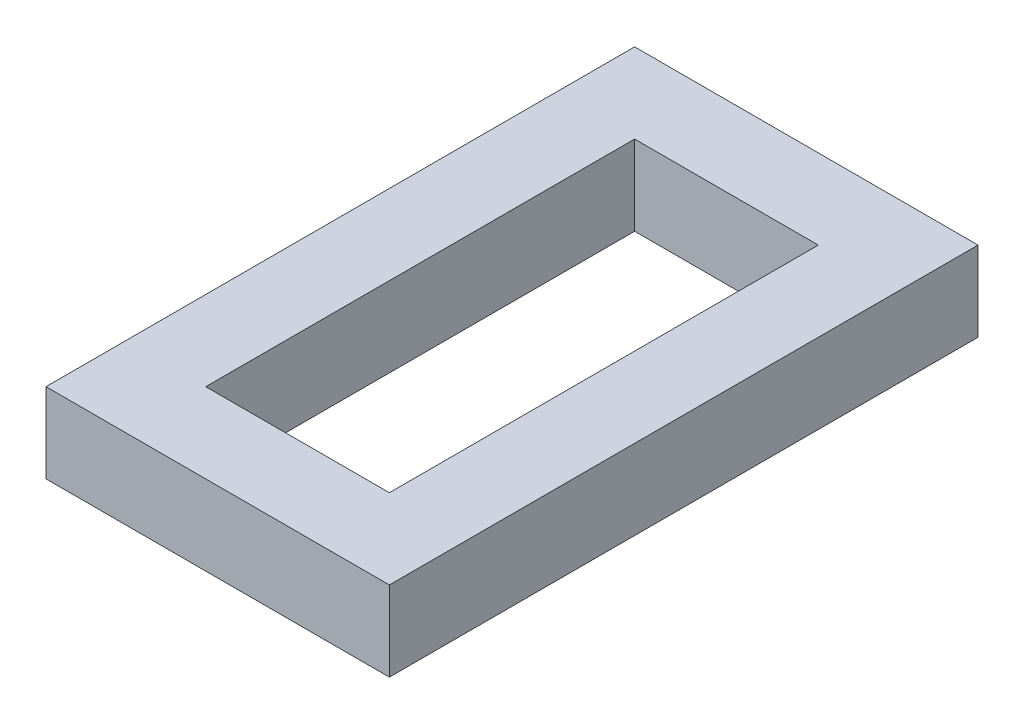
ISO-10303-21;
HEADER;
FILE_DESCRIPTION(('STEP AP214'),'2;1');
FILE_NAME('part.step','',(''),(''),'','','');
FILE_SCHEMA(('AUTOMOTIVE_DESIGN { 1 0 10303 214 1 1 1 1 }'));
ENDSEC;
DATA;
#1=APPLICATION_CONTEXT('core data for automotive mechanical design processes');
#2=APPLICATION_PROTOCOL_DEFINITION('international standard','automotive_design',2000,#1);
#3=PRODUCT_CONTEXT('',#1,'mechanical');
#4=PRODUCT('Part','Part','',(#3));
#5=PRODUCT_RELATED_PRODUCT_CATEGORY('part','',(#4));
#6=PRODUCT_DEFINITION_FORMATION('','',#4);
#7=PRODUCT_DEFINITION_CONTEXT('part definition',#1,'design');
#8=PRODUCT_DEFINITION('design','',#6,#7);
#9=PRODUCT_DEFINITION_SHAPE('','',#8);
#10=(LENGTH_UNIT() NAMED_UNIT(*) SI_UNIT(.MILLI.,.METRE.));
#11=(NAMED_UNIT(*) PLANE_ANGLE_UNIT() SI_UNIT($,.RADIAN.));
#12=(NAMED_UNIT(*) SI_UNIT($,.STERADIAN.) SOLID_ANGLE_UNIT());
#13=UNCERTAINTY_MEASURE_WITH_UNIT(LENGTH_MEASURE(1.E-05),#10,'distance_accuracy_value','');
#14=(GEOMETRIC_REPRESENTATION_CONTEXT(3) GLOBAL_UNCERTAINTY_ASSIGNED_CONTEXT((#13)) GLOBAL_UNIT_ASSIGNED_CONTEXT((#10,
#11,#12)) REPRESENTATION_CONTEXT('',''));
#15=CARTESIAN_POINT('',(0.,0.,0.));
#16=DIRECTION('',(0.,0.,1.));
#17=DIRECTION('',(1.,0.,0.));
#18=AXIS2_PLACEMENT_3D('',#15,#16,#17);
#19=CARTESIAN_POINT('',(0.,15.875,0.));
#20=DIRECTION('',(0.,-1.,0.));
#21=DIRECTION('',(0.,0.,-1.));
#22=AXIS2_PLACEMENT_3D('',#19,#20,#21);
#23=PLANE('',#22);
#24=DIRECTION('',(0.,0.,-1.));
#25=VECTOR('',#24,1.);
#26=CARTESIAN_POINT('',(34.125,15.875,58.5));
#27=LINE('',#26,#25);
#28=CARTESIAN_POINT('',(34.125,15.875,58.5));
#29=VERTEX_POINT('',#28);
#30=CARTESIAN_POINT('',(34.125,15.875,-58.5));
#31=VERTEX_POINT('',#30);
#32=EDGE_CURVE('E153',#29,#31,#27,.T.);
#33=ORIENTED_EDGE('',*,*,#32,.T.);
#34=DIRECTION('',(-1.,0.,0.));
#35=VECTOR('',#34,1.);
#36=CARTESIAN_POINT('',(-34.125,15.875,-58.5));
#37=LINE('',#36,#35);
#38=CARTESIAN_POINT('',(-34.125,15.875,-58.5));
#39=VERTEX_POINT('',#38);
#40=EDGE_CURVE('E157',#31,#39,#37,.T.);
#41=ORIENTED_EDGE('',*,*,#40,.T.);
#42=DIRECTION('',(0.,0.,1.));
#43=VECTOR('',#42,1.);
#44=CARTESIAN_POINT('',(-34.125,15.875,58.5));
#45=LINE('',#44,#43);
#46=CARTESIAN_POINT('',(-34.125,15.875,58.5));
#47=VERTEX_POINT('',#46);
#48=EDGE_CURVE('E161',#39,#47,#45,.T.);
#49=ORIENTED_EDGE('',*,*,#48,.T.);
#50=DIRECTION('',(1.,0.,0.));
#51=VECTOR('',#50,1.);
#52=CARTESIAN_POINT('',(-34.125,15.875,58.5));
#53=LINE('',#52,#51);
#54=EDGE_CURVE('E164',#47,#29,#53,.T.);
#55=ORIENTED_EDGE('',*,*,#54,.T.);
#56=EDGE_LOOP('',(#33,#41,#49,#55));
#57=FACE_BOUND('',#56,.T.);
#58=DIRECTION('',(1.,0.,0.));
#59=VECTOR('',#58,1.);
#60=CARTESIAN_POINT('',(-18.25,15.875,42.625));
#61=LINE('',#60,#59);
#62=CARTESIAN_POINT('',(-18.25,15.875,42.625));
#63=VERTEX_POINT('',#62);
#64=CARTESIAN_POINT('',(18.25,15.875,42.625));
#65=VERTEX_POINT('',#64);
#66=EDGE_CURVE('E105',#63,#65,#61,.T.);
#67=ORIENTED_EDGE('',*,*,#66,.F.);
#68=DIRECTION('',(0.,0.,1.));
#69=VECTOR('',#68,1.);
#70=CARTESIAN_POINT('',(-18.25,15.875,42.625));
#71=LINE('',#70,#69);
#72=CARTESIAN_POINT('',(-18.25,15.875,-42.625));
#73=VERTEX_POINT('',#72);
#74=EDGE_CURVE('E131',#73,#63,#71,.T.);
#75=ORIENTED_EDGE('',*,*,#74,.F.);
#76=DIRECTION('',(-1.,0.,0.));
#77=VECTOR('',#76,1.);
#78=CARTESIAN_POINT('',(-18.25,15.875,-42.625));
#79=LINE('',#78,#77);
#80=CARTESIAN_POINT('',(18.25,15.875,-42.625));
#81=VERTEX_POINT('',#80);
#82=EDGE_CURVE('E127',#81,#73,#79,.T.);
#83=ORIENTED_EDGE('',*,*,#82,.F.);
#84=DIRECTION('',(0.,0.,-1.));
#85=VECTOR('',#84,1.);
#86=CARTESIAN_POINT('',(18.25,15.875,42.625));
#87=LINE('',#86,#85);
#88=EDGE_CURVE('E114',#65,#81,#87,.T.);
#89=ORIENTED_EDGE('',*,*,#88,.F.);
#90=EDGE_LOOP('',(#67,#75,#83,#89));
#91=FACE_BOUND('',#90,.T.);
#92=ADVANCED_FACE('F39',(#57,#91),#23,.F.);
#93=CARTESIAN_POINT('',(0.,0.,0.));
#94=DIRECTION('',(0.,-1.,0.));
#95=DIRECTION('',(0.,0.,-1.));
#96=AXIS2_PLACEMENT_3D('',#93,#94,#95);
#97=PLANE('',#96);
#98=DIRECTION('',(0.,0.,-1.));
#99=VECTOR('',#98,1.);
#100=CARTESIAN_POINT('',(34.125,0.,58.5));
#101=LINE('',#100,#99);
#102=CARTESIAN_POINT('',(34.125,0.,58.5));
#103=VERTEX_POINT('',#102);
#104=CARTESIAN_POINT('',(34.125,0.,-58.5));
#105=VERTEX_POINT('',#104);
#106=EDGE_CURVE('E123',#103,#105,#101,.T.);
#107=ORIENTED_EDGE('',*,*,#106,.F.);
#108=DIRECTION('',(1.,0.,0.));
#109=VECTOR('',#108,1.);
#110=CARTESIAN_POINT('',(-34.125,0.,58.5));
#111=LINE('',#110,#109);
#112=CARTESIAN_POINT('',(-34.125,0.,58.5));
#113=VERTEX_POINT('',#112);
#114=EDGE_CURVE('E158',#113,#103,#111,.T.);
#115=ORIENTED_EDGE('',*,*,#114,.F.);
#116=DIRECTION('',(0.,0.,1.));
#117=VECTOR('',#116,1.);
#118=CARTESIAN_POINT('',(-34.125,0.,58.5));
#119=LINE('',#118,#117);
#120=CARTESIAN_POINT('',(-34.125,0.,-58.5));
#121=VERTEX_POINT('',#120);
#122=EDGE_CURVE('E174',#121,#113,#119,.T.);
#123=ORIENTED_EDGE('',*,*,#122,.F.);
#124=DIRECTION('',(-1.,0.,0.));
#125=VECTOR('',#124,1.);
#126=CARTESIAN_POINT('',(-34.125,0.,-58.5));
#127=LINE('',#126,#125);
#128=EDGE_CURVE('E171',#105,#121,#127,.T.);
#129=ORIENTED_EDGE('',*,*,#128,.F.);
#130=EDGE_LOOP('',(#107,#115,#123,#129));
#131=FACE_BOUND('',#130,.T.);
#132=DIRECTION('',(0.,0.,1.));
#133=VECTOR('',#132,1.);
#134=CARTESIAN_POINT('',(-18.25,0.,42.625));
#135=LINE('',#134,#133);
#136=CARTESIAN_POINT('',(-18.25,0.,-42.625));
#137=VERTEX_POINT('',#136);
#138=CARTESIAN_POINT('',(-18.25,0.,42.625));
#139=VERTEX_POINT('',#138);
#140=EDGE_CURVE('E115',#137,#139,#135,.T.);
#141=ORIENTED_EDGE('',*,*,#140,.T.);
#142=DIRECTION('',(1.,0.,0.));
#143=VECTOR('',#142,1.);
#144=CARTESIAN_POINT('',(-18.25,0.,42.625));
#145=LINE('',#144,#143);
#146=CARTESIAN_POINT('',(18.25,0.,42.625));
#147=VERTEX_POINT('',#146);
#148=EDGE_CURVE('E63',#139,#147,#145,.T.);
#149=ORIENTED_EDGE('',*,*,#148,.T.);
#150=DIRECTION('',(0.,0.,-1.));
#151=VECTOR('',#150,1.);
#152=CARTESIAN_POINT('',(18.25,0.,42.625));
#153=LINE('',#152,#151);
#154=CARTESIAN_POINT('',(18.25,0.,-42.625));
#155=VERTEX_POINT('',#154);
#156=EDGE_CURVE('E121',#147,#155,#153,.T.);
#157=ORIENTED_EDGE('',*,*,#156,.T.);
#158=DIRECTION('',(-1.,0.,0.));
#159=VECTOR('',#158,1.);
#160=CARTESIAN_POINT('',(-18.25,0.,-42.625));
#161=LINE('',#160,#159);
#162=EDGE_CURVE('E140',#155,#137,#161,.T.);
#163=ORIENTED_EDGE('',*,*,#162,.T.);
#164=EDGE_LOOP('',(#141,#149,#157,#163));
#165=FACE_BOUND('',#164,.T.);
#166=ADVANCED_FACE('F197',(#131,#165),#97,.T.);
#167=CARTESIAN_POINT('',(34.125,15.875,58.5));
#168=DIRECTION('',(-1.,0.,0.));
#169=DIRECTION('',(0.,0.,1.));
#170=AXIS2_PLACEMENT_3D('',#167,#168,#169);
#171=PLANE('',#170);
#172=ORIENTED_EDGE('',*,*,#106,.T.);
#173=DIRECTION('',(0.,-1.,0.));
#174=VECTOR('',#173,1.);
#175=CARTESIAN_POINT('',(34.125,15.875,-58.5));
#176=LINE('',#175,#174);
#177=EDGE_CURVE('E11',#31,#105,#176,.T.);
#178=ORIENTED_EDGE('',*,*,#177,.F.);
#179=ORIENTED_EDGE('',*,*,#32,.F.);
#180=DIRECTION('',(0.,-1.,0.));
#181=VECTOR('',#180,1.);
#182=CARTESIAN_POINT('',(34.125,15.875,58.5));
#183=LINE('',#182,#181);
#184=EDGE_CURVE('E167',#29,#103,#183,.T.);
#185=ORIENTED_EDGE('',*,*,#184,.T.);
#186=EDGE_LOOP('',(#172,#178,#179,#185));
#187=FACE_BOUND('',#186,.T.);
#188=ADVANCED_FACE('F41',(#187),#171,.F.);
#189=CARTESIAN_POINT('',(-34.125,15.875,-58.5));
#190=DIRECTION('',(0.,0.,1.));
#191=DIRECTION('',(1.,0.,0.));
#192=AXIS2_PLACEMENT_3D('',#189,#190,#191);
#193=PLANE('',#192);
#194=ORIENTED_EDGE('',*,*,#128,.T.);
#195=DIRECTION('',(0.,-1.,0.));
#196=VECTOR('',#195,1.);
#197=CARTESIAN_POINT('',(-34.125,15.875,-58.5));
#198=LINE('',#197,#196);
#199=EDGE_CURVE('E48',#39,#121,#198,.T.);
#200=ORIENTED_EDGE('',*,*,#199,.F.);
#201=ORIENTED_EDGE('',*,*,#40,.F.);
#202=ORIENTED_EDGE('',*,*,#177,.T.);
#203=EDGE_LOOP('',(#194,#200,#201,#202));
#204=FACE_BOUND('',#203,.T.);
#205=ADVANCED_FACE('F207',(#204),#193,.F.);
#206=CARTESIAN_POINT('',(-34.125,15.875,58.5));
#207=DIRECTION('',(1.,0.,0.));
#208=DIRECTION('',(0.,0.,-1.));
#209=AXIS2_PLACEMENT_3D('',#206,#207,#208);
#210=PLANE('',#209);
#211=ORIENTED_EDGE('',*,*,#122,.T.);
#212=DIRECTION('',(0.,-1.,0.));
#213=VECTOR('',#212,1.);
#214=CARTESIAN_POINT('',(-34.125,15.875,58.5));
#215=LINE('',#214,#213);
#216=EDGE_CURVE('E182',#47,#113,#215,.T.);
#217=ORIENTED_EDGE('',*,*,#216,.F.);
#218=ORIENTED_EDGE('',*,*,#48,.F.);
#219=ORIENTED_EDGE('',*,*,#199,.T.);
#220=EDGE_LOOP('',(#211,#217,#218,#219));
#221=FACE_BOUND('',#220,.T.);
#222=ADVANCED_FACE('F191',(#221),#210,.F.);
#223=CARTESIAN_POINT('',(-34.125,15.875,58.5));
#224=DIRECTION('',(0.,0.,-1.));
#225=DIRECTION('',(-1.,0.,0.));
#226=AXIS2_PLACEMENT_3D('',#223,#224,#225);
#227=PLANE('',#226);
#228=ORIENTED_EDGE('',*,*,#114,.T.);
#229=ORIENTED_EDGE('',*,*,#184,.F.);
#230=ORIENTED_EDGE('',*,*,#54,.F.);
#231=ORIENTED_EDGE('',*,*,#216,.T.);
#232=EDGE_LOOP('',(#228,#229,#230,#231));
#233=FACE_BOUND('',#232,.T.);
#234=ADVANCED_FACE('F201',(#233),#227,.F.);
#235=CARTESIAN_POINT('',(-18.25,15.875,42.625));
#236=DIRECTION('',(0.,0.,-1.));
#237=DIRECTION('',(-1.,0.,0.));
#238=AXIS2_PLACEMENT_3D('',#235,#236,#237);
#239=PLANE('',#238);
#240=ORIENTED_EDGE('',*,*,#148,.F.);
#241=DIRECTION('',(0.,-1.,0.));
#242=VECTOR('',#241,1.);
#243=CARTESIAN_POINT('',(-18.25,15.875,42.625));
#244=LINE('',#243,#242);
#245=EDGE_CURVE('E109',#63,#139,#244,.T.);
#246=ORIENTED_EDGE('',*,*,#245,.F.);
#247=ORIENTED_EDGE('',*,*,#66,.T.);
#248=DIRECTION('',(0.,-1.,0.));
#249=VECTOR('',#248,1.);
#250=CARTESIAN_POINT('',(18.25,15.875,42.625));
#251=LINE('',#250,#249);
#252=EDGE_CURVE('E108',#65,#147,#251,.T.);
#253=ORIENTED_EDGE('',*,*,#252,.T.);
#254=EDGE_LOOP('',(#240,#246,#247,#253));
#255=FACE_BOUND('',#254,.T.);
#256=ADVANCED_FACE('F107',(#255),#239,.T.);
#257=CARTESIAN_POINT('',(18.25,15.875,42.625));
#258=DIRECTION('',(-1.,0.,0.));
#259=DIRECTION('',(0.,0.,1.));
#260=AXIS2_PLACEMENT_3D('',#257,#258,#259);
#261=PLANE('',#260);
#262=ORIENTED_EDGE('',*,*,#156,.F.);
#263=ORIENTED_EDGE('',*,*,#252,.F.);
#264=ORIENTED_EDGE('',*,*,#88,.T.);
#265=DIRECTION('',(0.,-1.,0.));
#266=VECTOR('',#265,1.);
#267=CARTESIAN_POINT('',(18.25,15.875,-42.625));
#268=LINE('',#267,#266);
#269=EDGE_CURVE('E124',#81,#155,#268,.T.);
#270=ORIENTED_EDGE('',*,*,#269,.T.);
#271=EDGE_LOOP('',(#262,#263,#264,#270));
#272=FACE_BOUND('',#271,.T.);
#273=ADVANCED_FACE('F118',(#272),#261,.T.);
#274=CARTESIAN_POINT('',(-18.25,15.875,-42.625));
#275=DIRECTION('',(0.,0.,1.));
#276=DIRECTION('',(1.,0.,0.));
#277=AXIS2_PLACEMENT_3D('',#274,#275,#276);
#278=PLANE('',#277);
#279=ORIENTED_EDGE('',*,*,#162,.F.);
#280=ORIENTED_EDGE('',*,*,#269,.F.);
#281=ORIENTED_EDGE('',*,*,#82,.T.);
#282=DIRECTION('',(0.,-1.,0.));
#283=VECTOR('',#282,1.);
#284=CARTESIAN_POINT('',(-18.25,15.875,-42.625));
#285=LINE('',#284,#283);
#286=EDGE_CURVE('E55',#73,#137,#285,.T.);
#287=ORIENTED_EDGE('',*,*,#286,.T.);
#288=EDGE_LOOP('',(#279,#280,#281,#287));
#289=FACE_BOUND('',#288,.T.);
#290=ADVANCED_FACE('F230',(#289),#278,.T.);
#291=CARTESIAN_POINT('',(-18.25,15.875,42.625));
#292=DIRECTION('',(1.,0.,0.));
#293=DIRECTION('',(0.,0.,-1.));
#294=AXIS2_PLACEMENT_3D('',#291,#292,#293);
#295=PLANE('',#294);
#296=ORIENTED_EDGE('',*,*,#140,.F.);
#297=ORIENTED_EDGE('',*,*,#286,.F.);
#298=ORIENTED_EDGE('',*,*,#74,.T.);
#299=ORIENTED_EDGE('',*,*,#245,.T.);
#300=EDGE_LOOP('',(#296,#297,#298,#299));
#301=FACE_BOUND('',#300,.T.);
#302=ADVANCED_FACE('F234',(#301),#295,.T.);
#303=CLOSED_SHELL('',(#92,#166,#188,#205,#222,#234,#256,#273,#290,#302));
#304=MANIFOLD_SOLID_BREP('B2',#303);
#305=ADVANCED_BREP_SHAPE_REPRESENTATION('',(#18,#304),#14);
#306=SHAPE_DEFINITION_REPRESENTATION(#9,#305);
ENDSEC;
END-ISO-10303-21;
